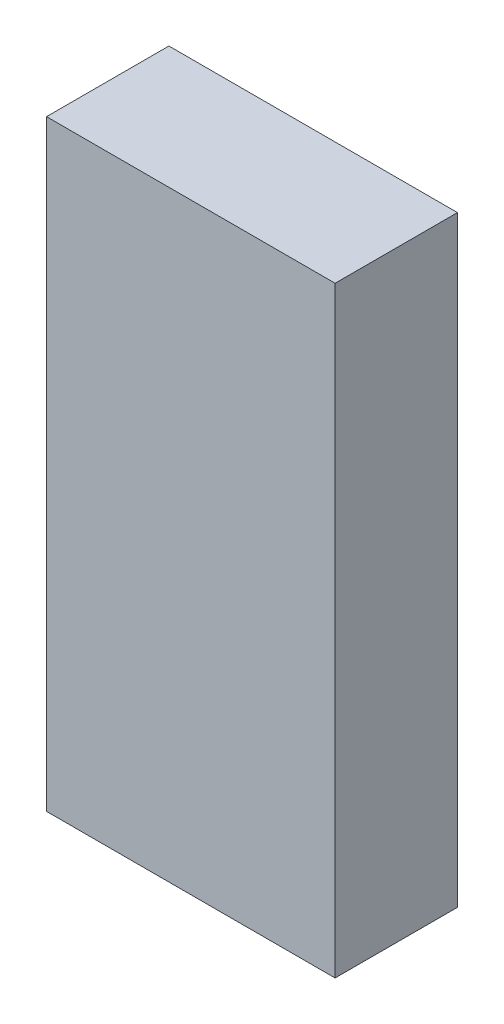
ISO-10303-21;
HEADER;
FILE_DESCRIPTION(('STEP AP214'),'2;1');
FILE_NAME('part.step','',(''),(''),'','','');
FILE_SCHEMA(('AUTOMOTIVE_DESIGN { 1 0 10303 214 1 1 1 1 }'));
ENDSEC;
DATA;
#1=APPLICATION_CONTEXT('core data for automotive mechanical design processes');
#2=APPLICATION_PROTOCOL_DEFINITION('international standard','automotive_design',2000,#1);
#3=PRODUCT_CONTEXT('',#1,'mechanical');
#4=PRODUCT('Part','Part','',(#3));
#5=PRODUCT_RELATED_PRODUCT_CATEGORY('part','',(#4));
#6=PRODUCT_DEFINITION_FORMATION('','',#4);
#7=PRODUCT_DEFINITION_CONTEXT('part definition',#1,'design');
#8=PRODUCT_DEFINITION('design','',#6,#7);
#9=PRODUCT_DEFINITION_SHAPE('','',#8);
#10=(LENGTH_UNIT() NAMED_UNIT(*) SI_UNIT(.MILLI.,.METRE.));
#11=(NAMED_UNIT(*) PLANE_ANGLE_UNIT() SI_UNIT($,.RADIAN.));
#12=(NAMED_UNIT(*) SI_UNIT($,.STERADIAN.) SOLID_ANGLE_UNIT());
#13=UNCERTAINTY_MEASURE_WITH_UNIT(LENGTH_MEASURE(1.E-05),#10,'distance_accuracy_value','');
#14=(GEOMETRIC_REPRESENTATION_CONTEXT(3) GLOBAL_UNCERTAINTY_ASSIGNED_CONTEXT((#13)) GLOBAL_UNIT_ASSIGNED_CONTEXT((#10,
#11,#12)) REPRESENTATION_CONTEXT('',''));
#15=CARTESIAN_POINT('',(0.,0.,0.));
#16=DIRECTION('',(0.,0.,1.));
#17=DIRECTION('',(1.,0.,0.));
#18=AXIS2_PLACEMENT_3D('',#15,#16,#17);
#19=CARTESIAN_POINT('',(0.2994914,0.62449202,0.));
#20=DIRECTION('',(0.,-1.,0.));
#21=DIRECTION('',(-1.,0.,0.));
#22=AXIS2_PLACEMENT_3D('',#19,#20,#21);
#23=PLANE('',#22);
#24=DIRECTION('',(-1.,0.,0.));
#25=VECTOR('',#24,1.);
#26=CARTESIAN_POINT('',(0.2994914,0.62449202,0.));
#27=LINE('',#26,#25);
#28=CARTESIAN_POINT('',(0.2994914,0.62449202,0.));
#29=VERTEX_POINT('',#28);
#30=CARTESIAN_POINT('',(-0.2994914,0.62449202,0.));
#31=VERTEX_POINT('',#30);
#32=EDGE_CURVE('E11',#29,#31,#27,.T.);
#33=ORIENTED_EDGE('',*,*,#32,.T.);
#34=DIRECTION('',(0.,0.,1.));
#35=VECTOR('',#34,1.);
#36=CARTESIAN_POINT('',(-0.2994914,0.62449202,0.));
#37=LINE('',#36,#35);
#38=CARTESIAN_POINT('',(-0.2994914,0.62449202,0.254));
#39=VERTEX_POINT('',#38);
#40=EDGE_CURVE('E24',#31,#39,#37,.T.);
#41=ORIENTED_EDGE('',*,*,#40,.T.);
#42=DIRECTION('',(-1.,0.,0.));
#43=VECTOR('',#42,1.);
#44=CARTESIAN_POINT('',(0.2994914,0.62449202,0.254));
#45=LINE('',#44,#43);
#46=CARTESIAN_POINT('',(0.2994914,0.62449202,0.254));
#47=VERTEX_POINT('',#46);
#48=EDGE_CURVE('E87',#47,#39,#45,.T.);
#49=ORIENTED_EDGE('',*,*,#48,.F.);
#50=DIRECTION('',(0.,0.,1.));
#51=VECTOR('',#50,1.);
#52=CARTESIAN_POINT('',(0.2994914,0.62449202,0.));
#53=LINE('',#52,#51);
#54=EDGE_CURVE('E36',#29,#47,#53,.T.);
#55=ORIENTED_EDGE('',*,*,#54,.F.);
#56=EDGE_LOOP('',(#33,#41,#49,#55));
#57=FACE_BOUND('',#56,.T.);
#58=ADVANCED_FACE('F17',(#57),#23,.F.);
#59=CARTESIAN_POINT('',(-0.2994914,0.62449202,0.));
#60=DIRECTION('',(1.,0.,0.));
#61=DIRECTION('',(0.,-1.,0.));
#62=AXIS2_PLACEMENT_3D('',#59,#60,#61);
#63=PLANE('',#62);
#64=DIRECTION('',(0.,-1.,0.));
#65=VECTOR('',#64,1.);
#66=CARTESIAN_POINT('',(-0.2994914,0.62449202,0.));
#67=LINE('',#66,#65);
#68=CARTESIAN_POINT('',(-0.2994914,-0.62449202,0.));
#69=VERTEX_POINT('',#68);
#70=EDGE_CURVE('E84',#31,#69,#67,.T.);
#71=ORIENTED_EDGE('',*,*,#70,.T.);
#72=DIRECTION('',(0.,0.,1.));
#73=VECTOR('',#72,1.);
#74=CARTESIAN_POINT('',(-0.2994914,-0.62449202,0.));
#75=LINE('',#74,#73);
#76=CARTESIAN_POINT('',(-0.2994914,-0.62449202,0.254));
#77=VERTEX_POINT('',#76);
#78=EDGE_CURVE('E82',#69,#77,#75,.T.);
#79=ORIENTED_EDGE('',*,*,#78,.T.);
#80=DIRECTION('',(0.,-1.,0.));
#81=VECTOR('',#80,1.);
#82=CARTESIAN_POINT('',(-0.2994914,0.62449202,0.254));
#83=LINE('',#82,#81);
#84=EDGE_CURVE('E62',#39,#77,#83,.T.);
#85=ORIENTED_EDGE('',*,*,#84,.F.);
#86=ORIENTED_EDGE('',*,*,#40,.F.);
#87=EDGE_LOOP('',(#71,#79,#85,#86));
#88=FACE_BOUND('',#87,.T.);
#89=ADVANCED_FACE('F89',(#88),#63,.F.);
#90=CARTESIAN_POINT('',(-0.2994914,-0.62449202,0.));
#91=DIRECTION('',(0.,1.,0.));
#92=DIRECTION('',(1.,0.,0.));
#93=AXIS2_PLACEMENT_3D('',#90,#91,#92);
#94=PLANE('',#93);
#95=DIRECTION('',(1.,0.,0.));
#96=VECTOR('',#95,1.);
#97=CARTESIAN_POINT('',(-0.2994914,-0.62449202,0.));
#98=LINE('',#97,#96);
#99=CARTESIAN_POINT('',(0.2994914,-0.62449202,0.));
#100=VERTEX_POINT('',#99);
#101=EDGE_CURVE('E71',#69,#100,#98,.T.);
#102=ORIENTED_EDGE('',*,*,#101,.T.);
#103=DIRECTION('',(0.,0.,1.));
#104=VECTOR('',#103,1.);
#105=CARTESIAN_POINT('',(0.2994914,-0.62449202,0.));
#106=LINE('',#105,#104);
#107=CARTESIAN_POINT('',(0.2994914,-0.62449202,0.254));
#108=VERTEX_POINT('',#107);
#109=EDGE_CURVE('E65',#100,#108,#106,.T.);
#110=ORIENTED_EDGE('',*,*,#109,.T.);
#111=DIRECTION('',(1.,0.,0.));
#112=VECTOR('',#111,1.);
#113=CARTESIAN_POINT('',(-0.2994914,-0.62449202,0.254));
#114=LINE('',#113,#112);
#115=EDGE_CURVE('E57',#77,#108,#114,.T.);
#116=ORIENTED_EDGE('',*,*,#115,.F.);
#117=ORIENTED_EDGE('',*,*,#78,.F.);
#118=EDGE_LOOP('',(#102,#110,#116,#117));
#119=FACE_BOUND('',#118,.T.);
#120=ADVANCED_FACE('F69',(#119),#94,.F.);
#121=CARTESIAN_POINT('',(0.2994914,-0.62449202,0.));
#122=DIRECTION('',(-1.,0.,0.));
#123=DIRECTION('',(0.,1.,0.));
#124=AXIS2_PLACEMENT_3D('',#121,#122,#123);
#125=PLANE('',#124);
#126=DIRECTION('',(0.,1.,0.));
#127=VECTOR('',#126,1.);
#128=CARTESIAN_POINT('',(0.2994914,-0.62449202,0.));
#129=LINE('',#128,#127);
#130=EDGE_CURVE('E66',#100,#29,#129,.T.);
#131=ORIENTED_EDGE('',*,*,#130,.T.);
#132=ORIENTED_EDGE('',*,*,#54,.T.);
#133=DIRECTION('',(0.,1.,0.));
#134=VECTOR('',#133,1.);
#135=CARTESIAN_POINT('',(0.2994914,-0.62449202,0.254));
#136=LINE('',#135,#134);
#137=EDGE_CURVE('E61',#108,#47,#136,.T.);
#138=ORIENTED_EDGE('',*,*,#137,.F.);
#139=ORIENTED_EDGE('',*,*,#109,.F.);
#140=EDGE_LOOP('',(#131,#132,#138,#139));
#141=FACE_BOUND('',#140,.T.);
#142=ADVANCED_FACE('F76',(#141),#125,.F.);
#143=CARTESIAN_POINT('',(0.2994914,0.62449202,0.));
#144=DIRECTION('',(0.,0.,-1.));
#145=DIRECTION('',(-1.,0.,0.));
#146=AXIS2_PLACEMENT_3D('',#143,#144,#145);
#147=PLANE('',#146);
#148=ORIENTED_EDGE('',*,*,#130,.F.);
#149=ORIENTED_EDGE('',*,*,#101,.F.);
#150=ORIENTED_EDGE('',*,*,#70,.F.);
#151=ORIENTED_EDGE('',*,*,#32,.F.);
#152=EDGE_LOOP('',(#148,#149,#150,#151));
#153=FACE_BOUND('',#152,.T.);
#154=ADVANCED_FACE('F91',(#153),#147,.T.);
#155=CARTESIAN_POINT('',(0.2994914,0.62449202,0.254));
#156=DIRECTION('',(0.,0.,-1.));
#157=DIRECTION('',(-1.,0.,0.));
#158=AXIS2_PLACEMENT_3D('',#155,#156,#157);
#159=PLANE('',#158);
#160=ORIENTED_EDGE('',*,*,#48,.T.);
#161=ORIENTED_EDGE('',*,*,#84,.T.);
#162=ORIENTED_EDGE('',*,*,#115,.T.);
#163=ORIENTED_EDGE('',*,*,#137,.T.);
#164=EDGE_LOOP('',(#160,#161,#162,#163));
#165=FACE_BOUND('',#164,.T.);
#166=ADVANCED_FACE('F59',(#165),#159,.F.);
#167=CLOSED_SHELL('',(#58,#89,#120,#142,#154,#166));
#168=MANIFOLD_SOLID_BREP('B1',#167);
#169=ADVANCED_BREP_SHAPE_REPRESENTATION('',(#18,#168),#14);
#170=SHAPE_DEFINITION_REPRESENTATION(#9,#169);
ENDSEC;
END-ISO-10303-21;
